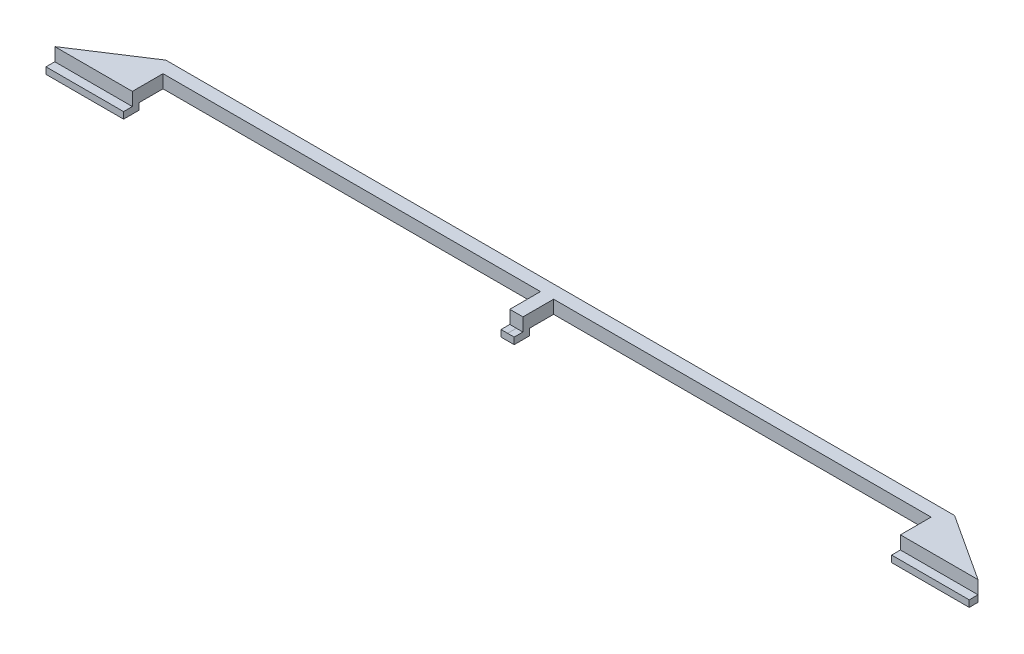
ISO-10303-21;
HEADER;
FILE_DESCRIPTION(('STEP AP214'),'2;1');
FILE_NAME('part.step','',(''),(''),'','','');
FILE_SCHEMA(('AUTOMOTIVE_DESIGN { 1 0 10303 214 1 1 1 1 }'));
ENDSEC;
DATA;
#1=APPLICATION_CONTEXT('core data for automotive mechanical design processes');
#2=APPLICATION_PROTOCOL_DEFINITION('international standard','automotive_design',2000,#1);
#3=PRODUCT_CONTEXT('',#1,'mechanical');
#4=PRODUCT('Part','Part','',(#3));
#5=PRODUCT_RELATED_PRODUCT_CATEGORY('part','',(#4));
#6=PRODUCT_DEFINITION_FORMATION('','',#4);
#7=PRODUCT_DEFINITION_CONTEXT('part definition',#1,'design');
#8=PRODUCT_DEFINITION('design','',#6,#7);
#9=PRODUCT_DEFINITION_SHAPE('','',#8);
#10=(LENGTH_UNIT() NAMED_UNIT(*) SI_UNIT(.MILLI.,.METRE.));
#11=(NAMED_UNIT(*) PLANE_ANGLE_UNIT() SI_UNIT($,.RADIAN.));
#12=(NAMED_UNIT(*) SI_UNIT($,.STERADIAN.) SOLID_ANGLE_UNIT());
#13=UNCERTAINTY_MEASURE_WITH_UNIT(LENGTH_MEASURE(1.E-05),#10,'distance_accuracy_value','');
#14=(GEOMETRIC_REPRESENTATION_CONTEXT(3) GLOBAL_UNCERTAINTY_ASSIGNED_CONTEXT((#13)) GLOBAL_UNIT_ASSIGNED_CONTEXT((#10,
#11,#12)) REPRESENTATION_CONTEXT('',''));
#15=CARTESIAN_POINT('',(0.,0.,0.));
#16=DIRECTION('',(0.,0.,1.));
#17=DIRECTION('',(1.,0.,0.));
#18=AXIS2_PLACEMENT_3D('',#15,#16,#17);
#19=CARTESIAN_POINT('',(450.,90.,85.));
#20=DIRECTION('',(0.,0.,1.));
#21=DIRECTION('',(1.,0.,0.));
#22=AXIS2_PLACEMENT_3D('',#19,#20,#21);
#23=PLANE('',#22);
#24=DIRECTION('',(1.,0.,0.));
#25=VECTOR('',#24,1.);
#26=CARTESIAN_POINT('',(450.,90.,85.));
#27=LINE('',#26,#25);
#28=CARTESIAN_POINT('',(435.,90.,85.));
#29=VERTEX_POINT('',#28);
#30=CARTESIAN_POINT('',(465.,90.,85.));
#31=VERTEX_POINT('',#30);
#32=EDGE_CURVE('E448',#29,#31,#27,.T.);
#33=ORIENTED_EDGE('',*,*,#32,.F.);
#34=DIRECTION('',(0.,-1.,0.));
#35=VECTOR('',#34,1.);
#36=CARTESIAN_POINT('',(435.,90.,85.));
#37=LINE('',#36,#35);
#38=CARTESIAN_POINT('',(435.,60.1054902683346,85.));
#39=VERTEX_POINT('',#38);
#40=EDGE_CURVE('E445',#29,#39,#37,.T.);
#41=ORIENTED_EDGE('',*,*,#40,.T.);
#42=DIRECTION('',(0.999975271591242,-0.00703251064853963,0.));
#43=VECTOR('',#42,1.);
#44=CARTESIAN_POINT('',(450.,60.,85.));
#45=LINE('',#44,#43);
#46=CARTESIAN_POINT('',(450.,60.,85.));
#47=VERTEX_POINT('',#46);
#48=EDGE_CURVE('E244',#39,#47,#45,.T.);
#49=ORIENTED_EDGE('',*,*,#48,.T.);
#50=DIRECTION('',(-0.999975271591242,-0.00703251064853963,0.));
#51=VECTOR('',#50,1.);
#52=CARTESIAN_POINT('',(450.,60.,85.));
#53=LINE('',#52,#51);
#54=CARTESIAN_POINT('',(465.,60.1054902683346,85.));
#55=VERTEX_POINT('',#54);
#56=EDGE_CURVE('E223',#55,#47,#53,.T.);
#57=ORIENTED_EDGE('',*,*,#56,.F.);
#58=DIRECTION('',(0.,-1.,0.));
#59=VECTOR('',#58,1.);
#60=CARTESIAN_POINT('',(465.,90.,85.));
#61=LINE('',#60,#59);
#62=EDGE_CURVE('E232',#31,#55,#61,.T.);
#63=ORIENTED_EDGE('',*,*,#62,.F.);
#64=EDGE_LOOP('',(#33,#41,#49,#57,#63));
#65=FACE_BOUND('',#64,.T.);
#66=ADVANCED_FACE('F41',(#65),#23,.T.);
#67=CARTESIAN_POINT('',(-603.496801426117,90.,84.9999999999999));
#68=DIRECTION('',(0.,0.,1.));
#69=DIRECTION('',(1.,0.,0.));
#70=AXIS2_PLACEMENT_3D('',#67,#68,#69);
#71=PLANE('',#70);
#72=DIRECTION('',(0.,-1.,0.));
#73=VECTOR('',#72,1.);
#74=CARTESIAN_POINT('',(-426.449083655733,90.,85.));
#75=LINE('',#74,#73);
#76=CARTESIAN_POINT('',(-426.449083655733,90.,85.));
#77=VERTEX_POINT('',#76);
#78=CARTESIAN_POINT('',(-426.449083655733,60.,85.));
#79=VERTEX_POINT('',#78);
#80=EDGE_CURVE('E472',#77,#79,#75,.T.);
#81=ORIENTED_EDGE('',*,*,#80,.F.);
#82=DIRECTION('',(1.,0.,0.));
#83=VECTOR('',#82,1.);
#84=CARTESIAN_POINT('',(-603.496801426117,90.,84.9999999999999));
#85=LINE('',#84,#83);
#86=CARTESIAN_POINT('',(-603.496801426117,90.,84.9999999999999));
#87=VERTEX_POINT('',#86);
#88=EDGE_CURVE('E461',#87,#77,#85,.T.);
#89=ORIENTED_EDGE('',*,*,#88,.F.);
#90=DIRECTION('',(0.,-1.,0.));
#91=VECTOR('',#90,1.);
#92=CARTESIAN_POINT('',(-603.496801426117,90.,84.9999999999999));
#93=LINE('',#92,#91);
#94=CARTESIAN_POINT('',(-603.496801426117,60.,85.));
#95=VERTEX_POINT('',#94);
#96=EDGE_CURVE('E478',#87,#95,#93,.T.);
#97=ORIENTED_EDGE('',*,*,#96,.T.);
#98=DIRECTION('',(1.,0.,0.));
#99=VECTOR('',#98,1.);
#100=CARTESIAN_POINT('',(-426.449083655733,60.,85.));
#101=LINE('',#100,#99);
#102=EDGE_CURVE('E388',#95,#79,#101,.T.);
#103=ORIENTED_EDGE('',*,*,#102,.T.);
#104=EDGE_LOOP('',(#81,#89,#97,#103));
#105=FACE_BOUND('',#104,.T.);
#106=ADVANCED_FACE('F519',(#105),#71,.T.);
#107=CARTESIAN_POINT('',(0.,60.,0.));
#108=DIRECTION('',(0.,1.,0.));
#109=DIRECTION('',(0.,0.,-1.));
#110=AXIS2_PLACEMENT_3D('',#107,#108,#109);
#111=PLANE('',#110);
#112=DIRECTION('',(-1.,0.,0.));
#113=VECTOR('',#112,1.);
#114=CARTESIAN_POINT('',(435.,60.,69.9999999999998));
#115=LINE('',#114,#113);
#116=CARTESIAN_POINT('',(465.,60.,69.9999999999998));
#117=VERTEX_POINT('',#116);
#118=CARTESIAN_POINT('',(435.,60.,69.9999999999998));
#119=VERTEX_POINT('',#118);
#120=EDGE_CURVE('E416',#117,#119,#115,.T.);
#121=ORIENTED_EDGE('',*,*,#120,.T.);
#122=DIRECTION('',(0.,0.,1.));
#123=VECTOR('',#122,1.);
#124=CARTESIAN_POINT('',(435.,60.,85.));
#125=LINE('',#124,#123);
#126=CARTESIAN_POINT('',(435.,60.,15.));
#127=VERTEX_POINT('',#126);
#128=EDGE_CURVE('E449',#127,#119,#125,.T.);
#129=ORIENTED_EDGE('',*,*,#128,.F.);
#130=DIRECTION('',(1.,0.,0.));
#131=VECTOR('',#130,1.);
#132=CARTESIAN_POINT('',(450.,60.,14.9999999999999));
#133=LINE('',#132,#131);
#134=CARTESIAN_POINT('',(-426.449083655733,60.,15.0000000000001));
#135=VERTEX_POINT('',#134);
#136=EDGE_CURVE('E490',#135,#127,#133,.T.);
#137=ORIENTED_EDGE('',*,*,#136,.F.);
#138=DIRECTION('',(0.,0.,-1.));
#139=VECTOR('',#138,1.);
#140=CARTESIAN_POINT('',(-426.449083655733,60.,85.));
#141=LINE('',#140,#139);
#142=CARTESIAN_POINT('',(-426.449083655733,60.,69.9999999999998));
#143=VERTEX_POINT('',#142);
#144=EDGE_CURVE('E460',#143,#135,#141,.T.);
#145=ORIENTED_EDGE('',*,*,#144,.F.);
#146=DIRECTION('',(-1.,0.,0.));
#147=VECTOR('',#146,1.);
#148=CARTESIAN_POINT('',(-580.472281212199,60.,69.9999999999998));
#149=LINE('',#148,#147);
#150=CARTESIAN_POINT('',(-580.472281212199,60.,69.9999999999998));
#151=VERTEX_POINT('',#150);
#152=EDGE_CURVE('E420',#143,#151,#149,.T.);
#153=ORIENTED_EDGE('',*,*,#152,.T.);
#154=DIRECTION('',(-0.837876769017591,0.,0.545859432400542));
#155=VECTOR('',#154,1.);
#156=CARTESIAN_POINT('',(-450.,60.,-14.9999999999999));
#157=LINE('',#156,#155);
#158=CARTESIAN_POINT('',(-450.,60.,-14.9999999999999));
#159=VERTEX_POINT('',#158);
#160=EDGE_CURVE('E466',#159,#151,#157,.T.);
#161=ORIENTED_EDGE('',*,*,#160,.F.);
#162=DIRECTION('',(-1.,0.,0.));
#163=VECTOR('',#162,1.);
#164=CARTESIAN_POINT('',(450.,60.,-15.0000000000001));
#165=LINE('',#164,#163);
#166=CARTESIAN_POINT('',(1350.,60.,-14.9999999999999));
#167=VERTEX_POINT('',#166);
#168=EDGE_CURVE('E50',#167,#159,#165,.T.);
#169=ORIENTED_EDGE('',*,*,#168,.F.);
#170=DIRECTION('',(0.837876769017591,0.,0.545859432400542));
#171=VECTOR('',#170,1.);
#172=CARTESIAN_POINT('',(1350.,60.,-14.9999999999999));
#173=LINE('',#172,#171);
#174=CARTESIAN_POINT('',(1480.4722812122,60.,69.9999999999998));
#175=VERTEX_POINT('',#174);
#176=EDGE_CURVE('E329',#167,#175,#173,.T.);
#177=ORIENTED_EDGE('',*,*,#176,.T.);
#178=DIRECTION('',(1.,0.,0.));
#179=VECTOR('',#178,1.);
#180=CARTESIAN_POINT('',(1480.4722812122,60.,69.9999999999998));
#181=LINE('',#180,#179);
#182=CARTESIAN_POINT('',(1326.44908365573,60.,69.9999999999998));
#183=VERTEX_POINT('',#182);
#184=EDGE_CURVE('E295',#183,#175,#181,.T.);
#185=ORIENTED_EDGE('',*,*,#184,.F.);
#186=DIRECTION('',(0.,0.,-1.));
#187=VECTOR('',#186,1.);
#188=CARTESIAN_POINT('',(1326.44908365573,60.,85.));
#189=LINE('',#188,#187);
#190=CARTESIAN_POINT('',(1326.44908365573,60.,15.0000000000001));
#191=VERTEX_POINT('',#190);
#192=EDGE_CURVE('E323',#183,#191,#189,.T.);
#193=ORIENTED_EDGE('',*,*,#192,.T.);
#194=DIRECTION('',(-1.,0.,0.));
#195=VECTOR('',#194,1.);
#196=CARTESIAN_POINT('',(450.,60.,14.9999999999999));
#197=LINE('',#196,#195);
#198=CARTESIAN_POINT('',(465.,60.,15.));
#199=VERTEX_POINT('',#198);
#200=EDGE_CURVE('E355',#191,#199,#197,.T.);
#201=ORIENTED_EDGE('',*,*,#200,.T.);
#202=DIRECTION('',(0.,0.,1.));
#203=VECTOR('',#202,1.);
#204=CARTESIAN_POINT('',(465.,60.,85.));
#205=LINE('',#204,#203);
#206=EDGE_CURVE('E315',#199,#117,#205,.T.);
#207=ORIENTED_EDGE('',*,*,#206,.T.);
#208=EDGE_LOOP('',(#121,#129,#137,#145,#153,#161,#169,#177,#185,#193,#201,#207));
#209=FACE_BOUND('',#208,.T.);
#210=ADVANCED_FACE('F552',(#209),#111,.F.);
#211=CARTESIAN_POINT('',(450.,60.,14.9999999999999));
#212=DIRECTION('',(0.,0.,-1.));
#213=DIRECTION('',(-1.,0.,0.));
#214=AXIS2_PLACEMENT_3D('',#211,#212,#213);
#215=PLANE('',#214);
#216=DIRECTION('',(1.,0.,0.));
#217=VECTOR('',#216,1.);
#218=CARTESIAN_POINT('',(450.,90.,14.9999999999999));
#219=LINE('',#218,#217);
#220=CARTESIAN_POINT('',(-426.449083655733,90.,15.0000000000001));
#221=VERTEX_POINT('',#220);
#222=CARTESIAN_POINT('',(435.,90.,15.));
#223=VERTEX_POINT('',#222);
#224=EDGE_CURVE('E489',#221,#223,#219,.T.);
#225=ORIENTED_EDGE('',*,*,#224,.F.);
#226=DIRECTION('',(0.,1.,0.));
#227=VECTOR('',#226,1.);
#228=CARTESIAN_POINT('',(-426.449083655733,60.,15.0000000000001));
#229=LINE('',#228,#227);
#230=EDGE_CURVE('E482',#135,#221,#229,.T.);
#231=ORIENTED_EDGE('',*,*,#230,.F.);
#232=ORIENTED_EDGE('',*,*,#136,.T.);
#233=DIRECTION('',(0.,-1.,0.));
#234=VECTOR('',#233,1.);
#235=CARTESIAN_POINT('',(435.,60.,14.9999999999999));
#236=LINE('',#235,#234);
#237=EDGE_CURVE('E452',#223,#127,#236,.T.);
#238=ORIENTED_EDGE('',*,*,#237,.F.);
#239=EDGE_LOOP('',(#225,#231,#232,#238));
#240=FACE_BOUND('',#239,.T.);
#241=ADVANCED_FACE('F43',(#240),#215,.F.);
#242=CARTESIAN_POINT('',(450.,60.,-15.0000000000001));
#243=DIRECTION('',(0.,0.,1.));
#244=DIRECTION('',(1.,0.,0.));
#245=AXIS2_PLACEMENT_3D('',#242,#243,#244);
#246=PLANE('',#245);
#247=DIRECTION('',(0.,1.,0.));
#248=VECTOR('',#247,1.);
#249=CARTESIAN_POINT('',(-450.,60.,-14.9999999999999));
#250=LINE('',#249,#248);
#251=CARTESIAN_POINT('',(-450.,90.,-14.9999999999999));
#252=VERTEX_POINT('',#251);
#253=EDGE_CURVE('E11',#159,#252,#250,.T.);
#254=ORIENTED_EDGE('',*,*,#253,.T.);
#255=DIRECTION('',(-1.,0.,0.));
#256=VECTOR('',#255,1.);
#257=CARTESIAN_POINT('',(450.,90.,-15.0000000000001));
#258=LINE('',#257,#256);
#259=CARTESIAN_POINT('',(1350.,90.,-14.9999999999999));
#260=VERTEX_POINT('',#259);
#261=EDGE_CURVE('E494',#260,#252,#258,.T.);
#262=ORIENTED_EDGE('',*,*,#261,.F.);
#263=DIRECTION('',(0.,1.,0.));
#264=VECTOR('',#263,1.);
#265=CARTESIAN_POINT('',(1350.,60.,-14.9999999999999));
#266=LINE('',#265,#264);
#267=EDGE_CURVE('E359',#167,#260,#266,.T.);
#268=ORIENTED_EDGE('',*,*,#267,.F.);
#269=ORIENTED_EDGE('',*,*,#168,.T.);
#270=EDGE_LOOP('',(#254,#262,#268,#269));
#271=FACE_BOUND('',#270,.T.);
#272=ADVANCED_FACE('F508',(#271),#246,.F.);
#273=CARTESIAN_POINT('',(0.,90.,0.));
#274=DIRECTION('',(0.,1.,0.));
#275=DIRECTION('',(0.,0.,-1.));
#276=AXIS2_PLACEMENT_3D('',#273,#274,#275);
#277=PLANE('',#276);
#278=DIRECTION('',(-0.837876769017591,0.,0.545859432400542));
#279=VECTOR('',#278,1.);
#280=CARTESIAN_POINT('',(-450.,90.,-14.9999999999999));
#281=LINE('',#280,#279);
#282=EDGE_CURVE('E469',#252,#87,#281,.T.);
#283=ORIENTED_EDGE('',*,*,#282,.T.);
#284=ORIENTED_EDGE('',*,*,#88,.T.);
#285=DIRECTION('',(0.,0.,-1.));
#286=VECTOR('',#285,1.);
#287=CARTESIAN_POINT('',(-426.449083655733,90.,85.));
#288=LINE('',#287,#286);
#289=EDGE_CURVE('E465',#77,#221,#288,.T.);
#290=ORIENTED_EDGE('',*,*,#289,.T.);
#291=ORIENTED_EDGE('',*,*,#224,.T.);
#292=DIRECTION('',(0.,0.,1.));
#293=VECTOR('',#292,1.);
#294=CARTESIAN_POINT('',(435.,90.,85.));
#295=LINE('',#294,#293);
#296=EDGE_CURVE('E453',#223,#29,#295,.T.);
#297=ORIENTED_EDGE('',*,*,#296,.T.);
#298=ORIENTED_EDGE('',*,*,#32,.T.);
#299=DIRECTION('',(0.,0.,1.));
#300=VECTOR('',#299,1.);
#301=CARTESIAN_POINT('',(465.,90.,85.));
#302=LINE('',#301,#300);
#303=CARTESIAN_POINT('',(465.,90.,15.));
#304=VERTEX_POINT('',#303);
#305=EDGE_CURVE('E235',#304,#31,#302,.T.);
#306=ORIENTED_EDGE('',*,*,#305,.F.);
#307=DIRECTION('',(-1.,0.,0.));
#308=VECTOR('',#307,1.);
#309=CARTESIAN_POINT('',(450.,90.,14.9999999999999));
#310=LINE('',#309,#308);
#311=CARTESIAN_POINT('',(1326.44908365573,90.,15.0000000000001));
#312=VERTEX_POINT('',#311);
#313=EDGE_CURVE('E354',#312,#304,#310,.T.);
#314=ORIENTED_EDGE('',*,*,#313,.F.);
#315=DIRECTION('',(0.,0.,-1.));
#316=VECTOR('',#315,1.);
#317=CARTESIAN_POINT('',(1326.44908365573,90.,85.));
#318=LINE('',#317,#316);
#319=CARTESIAN_POINT('',(1326.44908365573,90.,85.));
#320=VERTEX_POINT('',#319);
#321=EDGE_CURVE('E328',#320,#312,#318,.T.);
#322=ORIENTED_EDGE('',*,*,#321,.F.);
#323=DIRECTION('',(-1.,0.,0.));
#324=VECTOR('',#323,1.);
#325=CARTESIAN_POINT('',(1503.49680142612,90.,84.9999999999999));
#326=LINE('',#325,#324);
#327=CARTESIAN_POINT('',(1503.49680142612,90.,84.9999999999999));
#328=VERTEX_POINT('',#327);
#329=EDGE_CURVE('E324',#328,#320,#326,.T.);
#330=ORIENTED_EDGE('',*,*,#329,.F.);
#331=DIRECTION('',(0.837876769017591,0.,0.545859432400542));
#332=VECTOR('',#331,1.);
#333=CARTESIAN_POINT('',(1350.,90.,-14.9999999999999));
#334=LINE('',#333,#332);
#335=EDGE_CURVE('E333',#260,#328,#334,.T.);
#336=ORIENTED_EDGE('',*,*,#335,.F.);
#337=ORIENTED_EDGE('',*,*,#261,.T.);
#338=EDGE_LOOP('',(#283,#284,#290,#291,#297,#298,#306,#314,#322,#330,#336,#337));
#339=FACE_BOUND('',#338,.T.);
#340=ADVANCED_FACE('F504',(#339),#277,.T.);
#341=CARTESIAN_POINT('',(-426.449083655733,90.,85.));
#342=DIRECTION('',(1.,0.,0.));
#343=DIRECTION('',(0.,0.,-1.));
#344=AXIS2_PLACEMENT_3D('',#341,#342,#343);
#345=PLANE('',#344);
#346=ORIENTED_EDGE('',*,*,#230,.T.);
#347=ORIENTED_EDGE('',*,*,#289,.F.);
#348=ORIENTED_EDGE('',*,*,#80,.T.);
#349=DIRECTION('',(0.,0.,-1.));
#350=VECTOR('',#349,1.);
#351=CARTESIAN_POINT('',(-426.449083655733,60.,105.));
#352=LINE('',#351,#350);
#353=CARTESIAN_POINT('',(-426.449083655733,60.,105.));
#354=VERTEX_POINT('',#353);
#355=EDGE_CURVE('E407',#354,#79,#352,.T.);
#356=ORIENTED_EDGE('',*,*,#355,.F.);
#357=DIRECTION('',(0.,-1.,0.));
#358=VECTOR('',#357,1.);
#359=CARTESIAN_POINT('',(-426.449083655733,45.,105.));
#360=LINE('',#359,#358);
#361=CARTESIAN_POINT('',(-426.449083655733,45.,105.));
#362=VERTEX_POINT('',#361);
#363=EDGE_CURVE('E391',#354,#362,#360,.T.);
#364=ORIENTED_EDGE('',*,*,#363,.T.);
#365=DIRECTION('',(0.,0.,-1.));
#366=VECTOR('',#365,1.);
#367=CARTESIAN_POINT('',(-426.449083655733,45.,69.9999999999998));
#368=LINE('',#367,#366);
#369=CARTESIAN_POINT('',(-426.449083655733,45.,69.9999999999998));
#370=VERTEX_POINT('',#369);
#371=EDGE_CURVE('E427',#362,#370,#368,.T.);
#372=ORIENTED_EDGE('',*,*,#371,.T.);
#373=DIRECTION('',(0.,1.,0.));
#374=VECTOR('',#373,1.);
#375=CARTESIAN_POINT('',(-426.449083655733,45.,69.9999999999998));
#376=LINE('',#375,#374);
#377=EDGE_CURVE('E65',#370,#143,#376,.T.);
#378=ORIENTED_EDGE('',*,*,#377,.T.);
#379=ORIENTED_EDGE('',*,*,#144,.T.);
#380=EDGE_LOOP('',(#346,#347,#348,#356,#364,#372,#378,#379));
#381=FACE_BOUND('',#380,.T.);
#382=ADVANCED_FACE('F521',(#381),#345,.T.);
#383=CARTESIAN_POINT('',(-450.,90.,-14.9999999999999));
#384=DIRECTION('',(-0.545859432400542,0.,-0.837876769017591));
#385=DIRECTION('',(-0.837876769017591,0.,0.545859432400542));
#386=AXIS2_PLACEMENT_3D('',#383,#384,#385);
#387=PLANE('',#386);
#388=ORIENTED_EDGE('',*,*,#160,.T.);
#389=DIRECTION('',(0.,1.,0.));
#390=VECTOR('',#389,1.);
#391=CARTESIAN_POINT('',(-580.472281212199,45.,69.9999999999998));
#392=LINE('',#391,#390);
#393=CARTESIAN_POINT('',(-580.472281212199,45.,69.9999999999998));
#394=VERTEX_POINT('',#393);
#395=EDGE_CURVE('E437',#394,#151,#392,.T.);
#396=ORIENTED_EDGE('',*,*,#395,.F.);
#397=DIRECTION('',(-0.837876769017592,0.,0.545859432400541));
#398=VECTOR('',#397,1.);
#399=CARTESIAN_POINT('',(-603.496801426117,45.,84.9999999999999));
#400=LINE('',#399,#398);
#401=CARTESIAN_POINT('',(-603.496801426117,45.,85.));
#402=VERTEX_POINT('',#401);
#403=EDGE_CURVE('E433',#394,#402,#400,.T.);
#404=ORIENTED_EDGE('',*,*,#403,.T.);
#405=DIRECTION('',(0.,1.,0.));
#406=VECTOR('',#405,1.);
#407=CARTESIAN_POINT('',(-603.496801426117,60.,85.));
#408=LINE('',#407,#406);
#409=EDGE_CURVE('E372',#402,#95,#408,.T.);
#410=ORIENTED_EDGE('',*,*,#409,.T.);
#411=ORIENTED_EDGE('',*,*,#96,.F.);
#412=ORIENTED_EDGE('',*,*,#282,.F.);
#413=ORIENTED_EDGE('',*,*,#253,.F.);
#414=EDGE_LOOP('',(#388,#396,#404,#410,#411,#412,#413));
#415=FACE_BOUND('',#414,.T.);
#416=ADVANCED_FACE('F512',(#415),#387,.T.);
#417=CARTESIAN_POINT('',(435.,90.,85.));
#418=DIRECTION('',(-1.,0.,0.));
#419=DIRECTION('',(0.,0.,1.));
#420=AXIS2_PLACEMENT_3D('',#417,#418,#419);
#421=PLANE('',#420);
#422=ORIENTED_EDGE('',*,*,#237,.T.);
#423=ORIENTED_EDGE('',*,*,#128,.T.);
#424=DIRECTION('',(0.,1.,0.));
#425=VECTOR('',#424,1.);
#426=CARTESIAN_POINT('',(435.,45.,69.9999999999998));
#427=LINE('',#426,#425);
#428=CARTESIAN_POINT('',(435.,45.,69.9999999999998));
#429=VERTEX_POINT('',#428);
#430=EDGE_CURVE('E57',#429,#119,#427,.T.);
#431=ORIENTED_EDGE('',*,*,#430,.F.);
#432=DIRECTION('',(0.,0.,1.));
#433=VECTOR('',#432,1.);
#434=CARTESIAN_POINT('',(435.,45.,84.9999999999998));
#435=LINE('',#434,#433);
#436=CARTESIAN_POINT('',(435.,45.,105.));
#437=VERTEX_POINT('',#436);
#438=EDGE_CURVE('E415',#429,#437,#435,.T.);
#439=ORIENTED_EDGE('',*,*,#438,.T.);
#440=DIRECTION('',(0.,1.,0.));
#441=VECTOR('',#440,1.);
#442=CARTESIAN_POINT('',(435.,60.1054902683346,105.));
#443=LINE('',#442,#441);
#444=CARTESIAN_POINT('',(435.,60.1054902683346,105.));
#445=VERTEX_POINT('',#444);
#446=EDGE_CURVE('E373',#437,#445,#443,.T.);
#447=ORIENTED_EDGE('',*,*,#446,.T.);
#448=DIRECTION('',(0.,0.,-1.));
#449=VECTOR('',#448,1.);
#450=CARTESIAN_POINT('',(435.,60.1054902683346,105.));
#451=LINE('',#450,#449);
#452=EDGE_CURVE('E366',#445,#39,#451,.T.);
#453=ORIENTED_EDGE('',*,*,#452,.T.);
#454=ORIENTED_EDGE('',*,*,#40,.F.);
#455=ORIENTED_EDGE('',*,*,#296,.F.);
#456=EDGE_LOOP('',(#422,#423,#431,#439,#447,#453,#454,#455));
#457=FACE_BOUND('',#456,.T.);
#458=ADVANCED_FACE('F528',(#457),#421,.T.);
#459=CARTESIAN_POINT('',(-580.472281212199,45.,69.9999999999998));
#460=DIRECTION('',(0.,0.,1.));
#461=DIRECTION('',(1.,0.,0.));
#462=AXIS2_PLACEMENT_3D('',#459,#460,#461);
#463=PLANE('',#462);
#464=ORIENTED_EDGE('',*,*,#152,.F.);
#465=ORIENTED_EDGE('',*,*,#377,.F.);
#466=DIRECTION('',(-1.,0.,0.));
#467=VECTOR('',#466,1.);
#468=CARTESIAN_POINT('',(-580.472281212199,45.,69.9999999999998));
#469=LINE('',#468,#467);
#470=EDGE_CURVE('E430',#370,#394,#469,.T.);
#471=ORIENTED_EDGE('',*,*,#470,.T.);
#472=ORIENTED_EDGE('',*,*,#395,.T.);
#473=EDGE_LOOP('',(#464,#465,#471,#472));
#474=FACE_BOUND('',#473,.T.);
#475=ADVANCED_FACE('F554',(#474),#463,.F.);
#476=CARTESIAN_POINT('',(0.,45.,0.));
#477=DIRECTION('',(0.,-1.,0.));
#478=DIRECTION('',(0.,0.,1.));
#479=AXIS2_PLACEMENT_3D('',#476,#477,#478);
#480=PLANE('',#479);
#481=ORIENTED_EDGE('',*,*,#403,.F.);
#482=ORIENTED_EDGE('',*,*,#470,.F.);
#483=ORIENTED_EDGE('',*,*,#371,.F.);
#484=DIRECTION('',(-1.,0.,0.));
#485=VECTOR('',#484,1.);
#486=CARTESIAN_POINT('',(-603.496801426117,45.,105.));
#487=LINE('',#486,#485);
#488=CARTESIAN_POINT('',(-603.496801426117,45.,105.));
#489=VERTEX_POINT('',#488);
#490=EDGE_CURVE('E395',#362,#489,#487,.T.);
#491=ORIENTED_EDGE('',*,*,#490,.T.);
#492=DIRECTION('',(0.,0.,-1.));
#493=VECTOR('',#492,1.);
#494=CARTESIAN_POINT('',(-603.496801426117,45.,105.));
#495=LINE('',#494,#493);
#496=EDGE_CURVE('E398',#489,#402,#495,.T.);
#497=ORIENTED_EDGE('',*,*,#496,.T.);
#498=EDGE_LOOP('',(#481,#482,#483,#491,#497));
#499=FACE_BOUND('',#498,.T.);
#500=ADVANCED_FACE('F557',(#499),#480,.T.);
#501=CARTESIAN_POINT('',(435.,45.,69.9999999999998));
#502=DIRECTION('',(0.,0.,1.));
#503=DIRECTION('',(1.,0.,0.));
#504=AXIS2_PLACEMENT_3D('',#501,#502,#503);
#505=PLANE('',#504);
#506=ORIENTED_EDGE('',*,*,#120,.F.);
#507=DIRECTION('',(0.,1.,0.));
#508=VECTOR('',#507,1.);
#509=CARTESIAN_POINT('',(465.,45.,69.9999999999998));
#510=LINE('',#509,#508);
#511=CARTESIAN_POINT('',(465.,45.,69.9999999999998));
#512=VERTEX_POINT('',#511);
#513=EDGE_CURVE('E288',#512,#117,#510,.T.);
#514=ORIENTED_EDGE('',*,*,#513,.F.);
#515=DIRECTION('',(-1.,0.,0.));
#516=VECTOR('',#515,1.);
#517=CARTESIAN_POINT('',(435.,45.,69.9999999999998));
#518=LINE('',#517,#516);
#519=EDGE_CURVE('E421',#512,#429,#518,.T.);
#520=ORIENTED_EDGE('',*,*,#519,.T.);
#521=ORIENTED_EDGE('',*,*,#430,.T.);
#522=EDGE_LOOP('',(#506,#514,#520,#521));
#523=FACE_BOUND('',#522,.T.);
#524=ADVANCED_FACE('F746',(#523),#505,.F.);
#525=CARTESIAN_POINT('',(0.,45.,0.));
#526=DIRECTION('',(0.,1.,0.));
#527=DIRECTION('',(0.,0.,-1.));
#528=AXIS2_PLACEMENT_3D('',#525,#526,#527);
#529=PLANE('',#528);
#530=DIRECTION('',(-1.,0.,0.));
#531=VECTOR('',#530,1.);
#532=CARTESIAN_POINT('',(435.,45.,105.));
#533=LINE('',#532,#531);
#534=CARTESIAN_POINT('',(465.,45.,105.));
#535=VERTEX_POINT('',#534);
#536=EDGE_CURVE('E369',#535,#437,#533,.T.);
#537=ORIENTED_EDGE('',*,*,#536,.T.);
#538=ORIENTED_EDGE('',*,*,#438,.F.);
#539=ORIENTED_EDGE('',*,*,#519,.F.);
#540=DIRECTION('',(0.,0.,1.));
#541=VECTOR('',#540,1.);
#542=CARTESIAN_POINT('',(465.,45.,84.9999999999998));
#543=LINE('',#542,#541);
#544=EDGE_CURVE('E291',#512,#535,#543,.T.);
#545=ORIENTED_EDGE('',*,*,#544,.T.);
#546=EDGE_LOOP('',(#537,#538,#539,#545));
#547=FACE_BOUND('',#546,.T.);
#548=ADVANCED_FACE('F761',(#547),#529,.F.);
#549=CARTESIAN_POINT('',(-603.496801426117,60.,105.));
#550=DIRECTION('',(1.,0.,0.));
#551=DIRECTION('',(0.,0.,-1.));
#552=AXIS2_PLACEMENT_3D('',#549,#550,#551);
#553=PLANE('',#552);
#554=ORIENTED_EDGE('',*,*,#409,.F.);
#555=ORIENTED_EDGE('',*,*,#496,.F.);
#556=DIRECTION('',(0.,1.,0.));
#557=VECTOR('',#556,1.);
#558=CARTESIAN_POINT('',(-603.496801426117,60.,105.));
#559=LINE('',#558,#557);
#560=CARTESIAN_POINT('',(-603.496801426117,60.,105.));
#561=VERTEX_POINT('',#560);
#562=EDGE_CURVE('E383',#489,#561,#559,.T.);
#563=ORIENTED_EDGE('',*,*,#562,.T.);
#564=DIRECTION('',(0.,0.,-1.));
#565=VECTOR('',#564,1.);
#566=CARTESIAN_POINT('',(-603.496801426117,60.,105.));
#567=LINE('',#566,#565);
#568=EDGE_CURVE('E410',#561,#95,#567,.T.);
#569=ORIENTED_EDGE('',*,*,#568,.T.);
#570=EDGE_LOOP('',(#554,#555,#563,#569));
#571=FACE_BOUND('',#570,.T.);
#572=ADVANCED_FACE('F561',(#571),#553,.F.);
#573=CARTESIAN_POINT('',(-426.449083655733,60.,105.));
#574=DIRECTION('',(0.,-1.,0.));
#575=DIRECTION('',(-1.,0.,0.));
#576=AXIS2_PLACEMENT_3D('',#573,#574,#575);
#577=PLANE('',#576);
#578=ORIENTED_EDGE('',*,*,#102,.F.);
#579=ORIENTED_EDGE('',*,*,#568,.F.);
#580=DIRECTION('',(1.,0.,0.));
#581=VECTOR('',#580,1.);
#582=CARTESIAN_POINT('',(-426.449083655733,60.,105.));
#583=LINE('',#582,#581);
#584=EDGE_CURVE('E387',#561,#354,#583,.T.);
#585=ORIENTED_EDGE('',*,*,#584,.T.);
#586=ORIENTED_EDGE('',*,*,#355,.T.);
#587=EDGE_LOOP('',(#578,#579,#585,#586));
#588=FACE_BOUND('',#587,.T.);
#589=ADVANCED_FACE('F564',(#588),#577,.F.);
#590=CARTESIAN_POINT('',(0.,90.,105.));
#591=DIRECTION('',(0.,0.,-1.));
#592=DIRECTION('',(-1.,0.,0.));
#593=AXIS2_PLACEMENT_3D('',#590,#591,#592);
#594=PLANE('',#593);
#595=ORIENTED_EDGE('',*,*,#562,.F.);
#596=ORIENTED_EDGE('',*,*,#490,.F.);
#597=ORIENTED_EDGE('',*,*,#363,.F.);
#598=ORIENTED_EDGE('',*,*,#584,.F.);
#599=EDGE_LOOP('',(#595,#596,#597,#598));
#600=FACE_BOUND('',#599,.T.);
#601=ADVANCED_FACE('F568',(#600),#594,.F.);
#602=CARTESIAN_POINT('',(450.,60.,105.));
#603=DIRECTION('',(-0.00703251064853963,-0.999975271591242,0.));
#604=DIRECTION('',(-0.999975271591242,0.00703251064853963,0.));
#605=AXIS2_PLACEMENT_3D('',#602,#603,#604);
#606=PLANE('',#605);
#607=ORIENTED_EDGE('',*,*,#48,.F.);
#608=ORIENTED_EDGE('',*,*,#452,.F.);
#609=DIRECTION('',(0.999975271591242,-0.00703251064853963,0.));
#610=VECTOR('',#609,1.);
#611=CARTESIAN_POINT('',(450.,60.,105.));
#612=LINE('',#611,#610);
#613=CARTESIAN_POINT('',(450.,60.,105.));
#614=VERTEX_POINT('',#613);
#615=EDGE_CURVE('E376',#445,#614,#612,.T.);
#616=ORIENTED_EDGE('',*,*,#615,.T.);
#617=DIRECTION('',(0.,0.,-1.));
#618=VECTOR('',#617,1.);
#619=CARTESIAN_POINT('',(450.,60.,105.));
#620=LINE('',#619,#618);
#621=EDGE_CURVE('E229',#614,#47,#620,.T.);
#622=ORIENTED_EDGE('',*,*,#621,.T.);
#623=EDGE_LOOP('',(#607,#608,#616,#622));
#624=FACE_BOUND('',#623,.T.);
#625=ADVANCED_FACE('F570',(#624),#606,.F.);
#626=CARTESIAN_POINT('',(0.,90.,105.));
#627=DIRECTION('',(0.,0.,-1.));
#628=DIRECTION('',(-1.,0.,0.));
#629=AXIS2_PLACEMENT_3D('',#626,#627,#628);
#630=PLANE('',#629);
#631=ORIENTED_EDGE('',*,*,#446,.F.);
#632=ORIENTED_EDGE('',*,*,#536,.F.);
#633=DIRECTION('',(0.,1.,0.));
#634=VECTOR('',#633,1.);
#635=CARTESIAN_POINT('',(465.,60.1054902683346,105.));
#636=LINE('',#635,#634);
#637=CARTESIAN_POINT('',(465.,60.1054902683346,105.));
#638=VERTEX_POINT('',#637);
#639=EDGE_CURVE('E247',#535,#638,#636,.T.);
#640=ORIENTED_EDGE('',*,*,#639,.T.);
#641=DIRECTION('',(-0.999975271591242,-0.00703251064853963,0.));
#642=VECTOR('',#641,1.);
#643=CARTESIAN_POINT('',(450.,60.,105.));
#644=LINE('',#643,#642);
#645=EDGE_CURVE('E225',#638,#614,#644,.T.);
#646=ORIENTED_EDGE('',*,*,#645,.T.);
#647=ORIENTED_EDGE('',*,*,#615,.F.);
#648=EDGE_LOOP('',(#631,#632,#640,#646,#647));
#649=FACE_BOUND('',#648,.T.);
#650=ADVANCED_FACE('F576',(#649),#630,.F.);
#651=CARTESIAN_POINT('',(1503.49680142612,90.,84.9999999999999));
#652=DIRECTION('',(0.,0.,1.));
#653=DIRECTION('',(-1.,0.,0.));
#654=AXIS2_PLACEMENT_3D('',#651,#652,#653);
#655=PLANE('',#654);
#656=DIRECTION('',(0.,-1.,0.));
#657=VECTOR('',#656,1.);
#658=CARTESIAN_POINT('',(1326.44908365573,90.,85.));
#659=LINE('',#658,#657);
#660=CARTESIAN_POINT('',(1326.44908365573,60.,85.));
#661=VERTEX_POINT('',#660);
#662=EDGE_CURVE('E337',#320,#661,#659,.T.);
#663=ORIENTED_EDGE('',*,*,#662,.T.);
#664=DIRECTION('',(-1.,0.,0.));
#665=VECTOR('',#664,1.);
#666=CARTESIAN_POINT('',(1326.44908365573,60.,85.));
#667=LINE('',#666,#665);
#668=CARTESIAN_POINT('',(1503.49680142612,60.,85.));
#669=VERTEX_POINT('',#668);
#670=EDGE_CURVE('E253',#669,#661,#667,.T.);
#671=ORIENTED_EDGE('',*,*,#670,.F.);
#672=DIRECTION('',(0.,-1.,0.));
#673=VECTOR('',#672,1.);
#674=CARTESIAN_POINT('',(1503.49680142612,90.,84.9999999999999));
#675=LINE('',#674,#673);
#676=EDGE_CURVE('E344',#328,#669,#675,.T.);
#677=ORIENTED_EDGE('',*,*,#676,.F.);
#678=ORIENTED_EDGE('',*,*,#329,.T.);
#679=EDGE_LOOP('',(#663,#671,#677,#678));
#680=FACE_BOUND('',#679,.T.);
#681=ADVANCED_FACE('F543',(#680),#655,.T.);
#682=CARTESIAN_POINT('',(450.,60.,14.9999999999999));
#683=DIRECTION('',(0.,0.,-1.));
#684=DIRECTION('',(1.,0.,0.));
#685=AXIS2_PLACEMENT_3D('',#682,#683,#684);
#686=PLANE('',#685);
#687=ORIENTED_EDGE('',*,*,#313,.T.);
#688=DIRECTION('',(0.,-1.,0.));
#689=VECTOR('',#688,1.);
#690=CARTESIAN_POINT('',(465.,60.,14.9999999999999));
#691=LINE('',#690,#689);
#692=EDGE_CURVE('E318',#304,#199,#691,.T.);
#693=ORIENTED_EDGE('',*,*,#692,.T.);
#694=ORIENTED_EDGE('',*,*,#200,.F.);
#695=DIRECTION('',(0.,1.,0.));
#696=VECTOR('',#695,1.);
#697=CARTESIAN_POINT('',(1326.44908365573,60.,15.0000000000001));
#698=LINE('',#697,#696);
#699=EDGE_CURVE('E348',#191,#312,#698,.T.);
#700=ORIENTED_EDGE('',*,*,#699,.T.);
#701=EDGE_LOOP('',(#687,#693,#694,#700));
#702=FACE_BOUND('',#701,.T.);
#703=ADVANCED_FACE('F533',(#702),#686,.F.);
#704=CARTESIAN_POINT('',(1326.44908365573,90.,85.));
#705=DIRECTION('',(-1.,0.,0.));
#706=DIRECTION('',(0.,0.,-1.));
#707=AXIS2_PLACEMENT_3D('',#704,#705,#706);
#708=PLANE('',#707);
#709=ORIENTED_EDGE('',*,*,#699,.F.);
#710=ORIENTED_EDGE('',*,*,#192,.F.);
#711=DIRECTION('',(0.,1.,0.));
#712=VECTOR('',#711,1.);
#713=CARTESIAN_POINT('',(1326.44908365573,45.,69.9999999999998));
#714=LINE('',#713,#712);
#715=CARTESIAN_POINT('',(1326.44908365573,45.,69.9999999999998));
#716=VERTEX_POINT('',#715);
#717=EDGE_CURVE('E240',#716,#183,#714,.T.);
#718=ORIENTED_EDGE('',*,*,#717,.F.);
#719=DIRECTION('',(0.,0.,-1.));
#720=VECTOR('',#719,1.);
#721=CARTESIAN_POINT('',(1326.44908365573,45.,69.9999999999998));
#722=LINE('',#721,#720);
#723=CARTESIAN_POINT('',(1326.44908365573,45.,105.));
#724=VERTEX_POINT('',#723);
#725=EDGE_CURVE('E296',#724,#716,#722,.T.);
#726=ORIENTED_EDGE('',*,*,#725,.F.);
#727=DIRECTION('',(0.,-1.,0.));
#728=VECTOR('',#727,1.);
#729=CARTESIAN_POINT('',(1326.44908365573,45.,105.));
#730=LINE('',#729,#728);
#731=CARTESIAN_POINT('',(1326.44908365573,60.,105.));
#732=VERTEX_POINT('',#731);
#733=EDGE_CURVE('E268',#732,#724,#730,.T.);
#734=ORIENTED_EDGE('',*,*,#733,.F.);
#735=DIRECTION('',(0.,0.,-1.));
#736=VECTOR('',#735,1.);
#737=CARTESIAN_POINT('',(1326.44908365573,60.,105.));
#738=LINE('',#737,#736);
#739=EDGE_CURVE('E282',#732,#661,#738,.T.);
#740=ORIENTED_EDGE('',*,*,#739,.T.);
#741=ORIENTED_EDGE('',*,*,#662,.F.);
#742=ORIENTED_EDGE('',*,*,#321,.T.);
#743=EDGE_LOOP('',(#709,#710,#718,#726,#734,#740,#741,#742));
#744=FACE_BOUND('',#743,.T.);
#745=ADVANCED_FACE('F538',(#744),#708,.T.);
#746=CARTESIAN_POINT('',(1350.,90.,-14.9999999999999));
#747=DIRECTION('',(0.545859432400542,0.,-0.837876769017591));
#748=DIRECTION('',(0.837876769017591,0.,0.545859432400542));
#749=AXIS2_PLACEMENT_3D('',#746,#747,#748);
#750=PLANE('',#749);
#751=ORIENTED_EDGE('',*,*,#176,.F.);
#752=ORIENTED_EDGE('',*,*,#267,.T.);
#753=ORIENTED_EDGE('',*,*,#335,.T.);
#754=ORIENTED_EDGE('',*,*,#676,.T.);
#755=DIRECTION('',(0.,1.,0.));
#756=VECTOR('',#755,1.);
#757=CARTESIAN_POINT('',(1503.49680142612,60.,85.));
#758=LINE('',#757,#756);
#759=CARTESIAN_POINT('',(1503.49680142612,45.,85.));
#760=VERTEX_POINT('',#759);
#761=EDGE_CURVE('E246',#760,#669,#758,.T.);
#762=ORIENTED_EDGE('',*,*,#761,.F.);
#763=DIRECTION('',(0.837876769017592,0.,0.545859432400541));
#764=VECTOR('',#763,1.);
#765=CARTESIAN_POINT('',(1503.49680142612,45.,84.9999999999999));
#766=LINE('',#765,#764);
#767=CARTESIAN_POINT('',(1480.4722812122,45.,69.9999999999998));
#768=VERTEX_POINT('',#767);
#769=EDGE_CURVE('E303',#768,#760,#766,.T.);
#770=ORIENTED_EDGE('',*,*,#769,.F.);
#771=DIRECTION('',(0.,1.,0.));
#772=VECTOR('',#771,1.);
#773=CARTESIAN_POINT('',(1480.4722812122,45.,69.9999999999998));
#774=LINE('',#773,#772);
#775=EDGE_CURVE('E307',#768,#175,#774,.T.);
#776=ORIENTED_EDGE('',*,*,#775,.T.);
#777=EDGE_LOOP('',(#751,#752,#753,#754,#762,#770,#776));
#778=FACE_BOUND('',#777,.T.);
#779=ADVANCED_FACE('F547',(#778),#750,.T.);
#780=CARTESIAN_POINT('',(465.,90.,85.));
#781=DIRECTION('',(1.,0.,0.));
#782=DIRECTION('',(0.,0.,1.));
#783=AXIS2_PLACEMENT_3D('',#780,#781,#782);
#784=PLANE('',#783);
#785=ORIENTED_EDGE('',*,*,#692,.F.);
#786=ORIENTED_EDGE('',*,*,#305,.T.);
#787=ORIENTED_EDGE('',*,*,#62,.T.);
#788=DIRECTION('',(0.,0.,-1.));
#789=VECTOR('',#788,1.);
#790=CARTESIAN_POINT('',(465.,60.1054902683346,105.));
#791=LINE('',#790,#789);
#792=EDGE_CURVE('E218',#638,#55,#791,.T.);
#793=ORIENTED_EDGE('',*,*,#792,.F.);
#794=ORIENTED_EDGE('',*,*,#639,.F.);
#795=ORIENTED_EDGE('',*,*,#544,.F.);
#796=ORIENTED_EDGE('',*,*,#513,.T.);
#797=ORIENTED_EDGE('',*,*,#206,.F.);
#798=EDGE_LOOP('',(#785,#786,#787,#793,#794,#795,#796,#797));
#799=FACE_BOUND('',#798,.T.);
#800=ADVANCED_FACE('F233',(#799),#784,.T.);
#801=CARTESIAN_POINT('',(1480.4722812122,45.,69.9999999999998));
#802=DIRECTION('',(0.,0.,1.));
#803=DIRECTION('',(-1.,0.,0.));
#804=AXIS2_PLACEMENT_3D('',#801,#802,#803);
#805=PLANE('',#804);
#806=ORIENTED_EDGE('',*,*,#184,.T.);
#807=ORIENTED_EDGE('',*,*,#775,.F.);
#808=DIRECTION('',(1.,0.,0.));
#809=VECTOR('',#808,1.);
#810=CARTESIAN_POINT('',(1480.4722812122,45.,69.9999999999998));
#811=LINE('',#810,#809);
#812=EDGE_CURVE('E300',#716,#768,#811,.T.);
#813=ORIENTED_EDGE('',*,*,#812,.F.);
#814=ORIENTED_EDGE('',*,*,#717,.T.);
#815=EDGE_LOOP('',(#806,#807,#813,#814));
#816=FACE_BOUND('',#815,.T.);
#817=ADVANCED_FACE('F891',(#816),#805,.F.);
#818=CARTESIAN_POINT('',(900.,45.,0.));
#819=DIRECTION('',(0.,-1.,0.));
#820=DIRECTION('',(0.,0.,1.));
#821=AXIS2_PLACEMENT_3D('',#818,#819,#820);
#822=PLANE('',#821);
#823=ORIENTED_EDGE('',*,*,#769,.T.);
#824=DIRECTION('',(0.,0.,-1.));
#825=VECTOR('',#824,1.);
#826=CARTESIAN_POINT('',(1503.49680142612,45.,105.));
#827=LINE('',#826,#825);
#828=CARTESIAN_POINT('',(1503.49680142612,45.,105.));
#829=VERTEX_POINT('',#828);
#830=EDGE_CURVE('E275',#829,#760,#827,.T.);
#831=ORIENTED_EDGE('',*,*,#830,.F.);
#832=DIRECTION('',(1.,0.,0.));
#833=VECTOR('',#832,1.);
#834=CARTESIAN_POINT('',(1503.49680142612,45.,105.));
#835=LINE('',#834,#833);
#836=EDGE_CURVE('E272',#724,#829,#835,.T.);
#837=ORIENTED_EDGE('',*,*,#836,.F.);
#838=ORIENTED_EDGE('',*,*,#725,.T.);
#839=ORIENTED_EDGE('',*,*,#812,.T.);
#840=EDGE_LOOP('',(#823,#831,#837,#838,#839));
#841=FACE_BOUND('',#840,.T.);
#842=ADVANCED_FACE('F908',(#841),#822,.T.);
#843=CARTESIAN_POINT('',(1503.49680142612,60.,105.));
#844=DIRECTION('',(-1.,0.,0.));
#845=DIRECTION('',(0.,0.,-1.));
#846=AXIS2_PLACEMENT_3D('',#843,#844,#845);
#847=PLANE('',#846);
#848=ORIENTED_EDGE('',*,*,#761,.T.);
#849=DIRECTION('',(0.,0.,-1.));
#850=VECTOR('',#849,1.);
#851=CARTESIAN_POINT('',(1503.49680142612,60.,105.));
#852=LINE('',#851,#850);
#853=CARTESIAN_POINT('',(1503.49680142612,60.,105.));
#854=VERTEX_POINT('',#853);
#855=EDGE_CURVE('E285',#854,#669,#852,.T.);
#856=ORIENTED_EDGE('',*,*,#855,.F.);
#857=DIRECTION('',(0.,1.,0.));
#858=VECTOR('',#857,1.);
#859=CARTESIAN_POINT('',(1503.49680142612,60.,105.));
#860=LINE('',#859,#858);
#861=EDGE_CURVE('E261',#829,#854,#860,.T.);
#862=ORIENTED_EDGE('',*,*,#861,.F.);
#863=ORIENTED_EDGE('',*,*,#830,.T.);
#864=EDGE_LOOP('',(#848,#856,#862,#863));
#865=FACE_BOUND('',#864,.T.);
#866=ADVANCED_FACE('F920',(#865),#847,.F.);
#867=CARTESIAN_POINT('',(1326.44908365573,60.,105.));
#868=DIRECTION('',(0.,-1.,0.));
#869=DIRECTION('',(1.,0.,0.));
#870=AXIS2_PLACEMENT_3D('',#867,#868,#869);
#871=PLANE('',#870);
#872=ORIENTED_EDGE('',*,*,#670,.T.);
#873=ORIENTED_EDGE('',*,*,#739,.F.);
#874=DIRECTION('',(-1.,0.,0.));
#875=VECTOR('',#874,1.);
#876=CARTESIAN_POINT('',(1326.44908365573,60.,105.));
#877=LINE('',#876,#875);
#878=EDGE_CURVE('E265',#854,#732,#877,.T.);
#879=ORIENTED_EDGE('',*,*,#878,.F.);
#880=ORIENTED_EDGE('',*,*,#855,.T.);
#881=EDGE_LOOP('',(#872,#873,#879,#880));
#882=FACE_BOUND('',#881,.T.);
#883=ADVANCED_FACE('F935',(#882),#871,.F.);
#884=CARTESIAN_POINT('',(900.,90.,105.));
#885=DIRECTION('',(0.,0.,-1.));
#886=DIRECTION('',(1.,0.,0.));
#887=AXIS2_PLACEMENT_3D('',#884,#885,#886);
#888=PLANE('',#887);
#889=ORIENTED_EDGE('',*,*,#861,.T.);
#890=ORIENTED_EDGE('',*,*,#878,.T.);
#891=ORIENTED_EDGE('',*,*,#733,.T.);
#892=ORIENTED_EDGE('',*,*,#836,.T.);
#893=EDGE_LOOP('',(#889,#890,#891,#892));
#894=FACE_BOUND('',#893,.T.);
#895=ADVANCED_FACE('F947',(#894),#888,.F.);
#896=CARTESIAN_POINT('',(450.,60.,105.));
#897=DIRECTION('',(0.00703251064853963,-0.999975271591242,0.));
#898=DIRECTION('',(0.999975271591242,0.00703251064853963,0.));
#899=AXIS2_PLACEMENT_3D('',#896,#897,#898);
#900=PLANE('',#899);
#901=ORIENTED_EDGE('',*,*,#56,.T.);
#902=ORIENTED_EDGE('',*,*,#621,.F.);
#903=ORIENTED_EDGE('',*,*,#645,.F.);
#904=ORIENTED_EDGE('',*,*,#792,.T.);
#905=EDGE_LOOP('',(#901,#902,#903,#904));
#906=FACE_BOUND('',#905,.T.);
#907=ADVANCED_FACE('F220',(#906),#900,.F.);
#908=CLOSED_SHELL('',(#66,#106,#210,#241,#272,#340,#382,#416,#458,#475,#500,#524,#548,#572,#589,
#601,#625,#650,#681,#703,#745,#779,#800,#817,#842,#866,#883,#895,#907));
#909=MANIFOLD_SOLID_BREP('B2',#908);
#910=ADVANCED_BREP_SHAPE_REPRESENTATION('',(#18,#909),#14);
#911=SHAPE_DEFINITION_REPRESENTATION(#9,#910);
ENDSEC;
END-ISO-10303-21;
